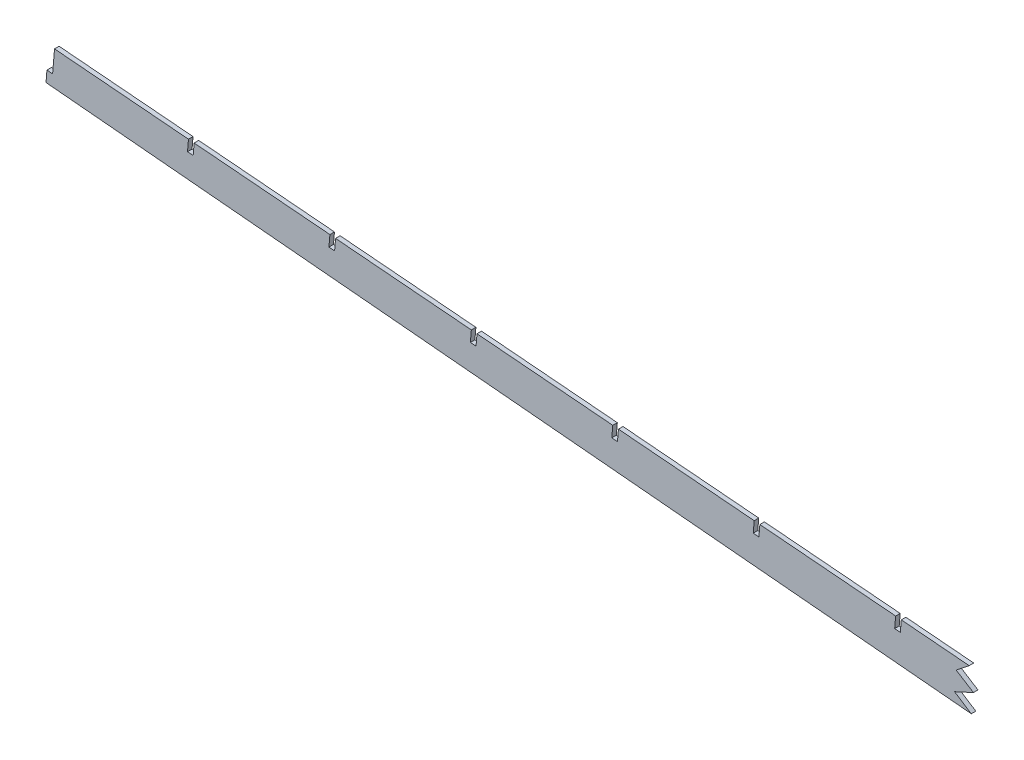
ISO-10303-21;
HEADER;
FILE_DESCRIPTION(('STEP AP214'),'2;1');
FILE_NAME('part.step','',(''),(''),'','','');
FILE_SCHEMA(('AUTOMOTIVE_DESIGN { 1 0 10303 214 1 1 1 1 }'));
ENDSEC;
DATA;
#1=APPLICATION_CONTEXT('core data for automotive mechanical design processes');
#2=APPLICATION_PROTOCOL_DEFINITION('international standard','automotive_design',2000,#1);
#3=PRODUCT_CONTEXT('',#1,'mechanical');
#4=PRODUCT('Part','Part','',(#3));
#5=PRODUCT_RELATED_PRODUCT_CATEGORY('part','',(#4));
#6=PRODUCT_DEFINITION_FORMATION('','',#4);
#7=PRODUCT_DEFINITION_CONTEXT('part definition',#1,'design');
#8=PRODUCT_DEFINITION('design','',#6,#7);
#9=PRODUCT_DEFINITION_SHAPE('','',#8);
#10=(LENGTH_UNIT() NAMED_UNIT(*) SI_UNIT(.MILLI.,.METRE.));
#11=(NAMED_UNIT(*) PLANE_ANGLE_UNIT() SI_UNIT($,.RADIAN.));
#12=(NAMED_UNIT(*) SI_UNIT($,.STERADIAN.) SOLID_ANGLE_UNIT());
#13=UNCERTAINTY_MEASURE_WITH_UNIT(LENGTH_MEASURE(1.E-05),#10,'distance_accuracy_value','');
#14=(GEOMETRIC_REPRESENTATION_CONTEXT(3) GLOBAL_UNCERTAINTY_ASSIGNED_CONTEXT((#13)) GLOBAL_UNIT_ASSIGNED_CONTEXT((#10,
#11,#12)) REPRESENTATION_CONTEXT('',''));
#15=CARTESIAN_POINT('',(0.,0.,0.));
#16=DIRECTION('',(0.,0.,1.));
#17=DIRECTION('',(1.,0.,0.));
#18=AXIS2_PLACEMENT_3D('',#15,#16,#17);
#19=CARTESIAN_POINT('',(1.61761442276217,19.2636563887038,2.54));
#20=DIRECTION('',(-0.083677843332315,-0.996492859249504,0.));
#21=DIRECTION('',(0.996492859249504,-0.083677843332315,0.));
#22=AXIS2_PLACEMENT_3D('',#19,#20,#21);
#23=PLANE('',#22);
#24=DIRECTION('',(0.,0.,1.));
#25=VECTOR('',#24,1.);
#26=CARTESIAN_POINT('',(-434.187522505009,55.8592362092406,-5.08));
#27=LINE('',#26,#25);
#28=CARTESIAN_POINT('',(-434.187522505009,55.8592362092406,0.));
#29=VERTEX_POINT('',#28);
#30=CARTESIAN_POINT('',(-434.187522505009,55.8592362092406,2.54));
#31=VERTEX_POINT('',#30);
#32=EDGE_CURVE('E381',#29,#31,#27,.T.);
#33=ORIENTED_EDGE('',*,*,#32,.F.);
#34=DIRECTION('',(-0.996492859249504,0.083677843332315,0.));
#35=VECTOR('',#34,1.);
#36=CARTESIAN_POINT('',(1.61761442276217,19.2636563887038,0.));
#37=LINE('',#36,#35);
#38=CARTESIAN_POINT('',(-472.090623145853,59.0420484971502,0.));
#39=VERTEX_POINT('',#38);
#40=EDGE_CURVE('E327',#29,#39,#37,.T.);
#41=ORIENTED_EDGE('',*,*,#40,.T.);
#42=DIRECTION('',(0.,0.,1.));
#43=VECTOR('',#42,1.);
#44=CARTESIAN_POINT('',(-472.090623145853,59.0420484971502,0.));
#45=LINE('',#44,#43);
#46=CARTESIAN_POINT('',(-472.090623145853,59.0420484971502,2.54));
#47=VERTEX_POINT('',#46);
#48=EDGE_CURVE('E526',#39,#47,#45,.T.);
#49=ORIENTED_EDGE('',*,*,#48,.T.);
#50=DIRECTION('',(-0.996492859249504,0.083677843332315,0.));
#51=VECTOR('',#50,1.);
#52=CARTESIAN_POINT('',(1.61761442276217,19.2636563887038,2.54));
#53=LINE('',#52,#51);
#54=EDGE_CURVE('E301',#31,#47,#53,.T.);
#55=ORIENTED_EDGE('',*,*,#54,.F.);
#56=EDGE_LOOP('',(#33,#41,#49,#55));
#57=FACE_BOUND('',#56,.T.);
#58=ADVANCED_FACE('F44',(#57),#23,.F.);
#59=DIRECTION('',(0.,0.,1.));
#60=VECTOR('',#59,1.);
#61=CARTESIAN_POINT('',(-866.940953694876,92.1985571391467,0.));
#62=LINE('',#61,#60);
#63=CARTESIAN_POINT('',(-866.940953694876,92.1985571391467,0.));
#64=VERTEX_POINT('',#63);
#65=CARTESIAN_POINT('',(-866.940953694876,92.1985571391467,2.54));
#66=VERTEX_POINT('',#65);
#67=EDGE_CURVE('E68',#64,#66,#62,.T.);
#68=ORIENTED_EDGE('',*,*,#67,.T.);
#69=CARTESIAN_POINT('',(-791.134752413189,85.8329325633276,2.54));
#70=VERTEX_POINT('',#69);
#71=EDGE_CURVE('E299',#70,#66,#53,.T.);
#72=ORIENTED_EDGE('',*,*,#71,.F.);
#73=DIRECTION('',(0.,0.,1.));
#74=VECTOR('',#73,1.);
#75=CARTESIAN_POINT('',(-791.134752413189,85.8329325633276,0.));
#76=LINE('',#75,#74);
#77=CARTESIAN_POINT('',(-791.134752413189,85.8329325633276,0.));
#78=VERTEX_POINT('',#77);
#79=EDGE_CURVE('E425',#78,#70,#76,.T.);
#80=ORIENTED_EDGE('',*,*,#79,.F.);
#81=EDGE_CURVE('E621',#78,#64,#37,.T.);
#82=ORIENTED_EDGE('',*,*,#81,.T.);
#83=EDGE_LOOP('',(#68,#72,#80,#82));
#84=FACE_BOUND('',#83,.T.);
#85=ADVANCED_FACE('F694',(#84),#23,.F.);
#86=DIRECTION('',(0.,0.,1.));
#87=VECTOR('',#86,1.);
#88=CARTESIAN_POINT('',(-787.970887585072,85.5672554107474,0.));
#89=LINE('',#88,#87);
#90=CARTESIAN_POINT('',(-787.970887585072,85.5672554107474,0.));
#91=VERTEX_POINT('',#90);
#92=CARTESIAN_POINT('',(-787.970887585072,85.5672554107474,2.54));
#93=VERTEX_POINT('',#92);
#94=EDGE_CURVE('E428',#91,#93,#89,.T.);
#95=ORIENTED_EDGE('',*,*,#94,.T.);
#96=CARTESIAN_POINT('',(-712.164686303384,79.2016308349282,2.54));
#97=VERTEX_POINT('',#96);
#98=EDGE_CURVE('E680',#97,#93,#53,.T.);
#99=ORIENTED_EDGE('',*,*,#98,.F.);
#100=DIRECTION('',(0.,0.,1.));
#101=VECTOR('',#100,1.);
#102=CARTESIAN_POINT('',(-712.164686303384,79.2016308349282,0.));
#103=LINE('',#102,#101);
#104=CARTESIAN_POINT('',(-712.164686303384,79.2016308349282,0.));
#105=VERTEX_POINT('',#104);
#106=EDGE_CURVE('E450',#105,#97,#103,.T.);
#107=ORIENTED_EDGE('',*,*,#106,.F.);
#108=EDGE_CURVE('E625',#105,#91,#37,.T.);
#109=ORIENTED_EDGE('',*,*,#108,.T.);
#110=EDGE_LOOP('',(#95,#99,#107,#109));
#111=FACE_BOUND('',#110,.T.);
#112=ADVANCED_FACE('F722',(#111),#23,.F.);
#113=DIRECTION('',(0.,0.,1.));
#114=VECTOR('',#113,1.);
#115=CARTESIAN_POINT('',(-709.000821475267,78.9359536823482,0.));
#116=LINE('',#115,#114);
#117=CARTESIAN_POINT('',(-709.000821475267,78.9359536823482,0.));
#118=VERTEX_POINT('',#117);
#119=CARTESIAN_POINT('',(-709.000821475267,78.9359536823482,2.54));
#120=VERTEX_POINT('',#119);
#121=EDGE_CURVE('E453',#118,#120,#116,.T.);
#122=ORIENTED_EDGE('',*,*,#121,.T.);
#123=CARTESIAN_POINT('',(-633.19462019358,72.5703291065289,2.54));
#124=VERTEX_POINT('',#123);
#125=EDGE_CURVE('E676',#124,#120,#53,.T.);
#126=ORIENTED_EDGE('',*,*,#125,.F.);
#127=DIRECTION('',(0.,0.,1.));
#128=VECTOR('',#127,1.);
#129=CARTESIAN_POINT('',(-633.19462019358,72.5703291065289,0.));
#130=LINE('',#129,#128);
#131=CARTESIAN_POINT('',(-633.19462019358,72.5703291065289,0.));
#132=VERTEX_POINT('',#131);
#133=EDGE_CURVE('E475',#132,#124,#130,.T.);
#134=ORIENTED_EDGE('',*,*,#133,.F.);
#135=EDGE_CURVE('E632',#132,#118,#37,.T.);
#136=ORIENTED_EDGE('',*,*,#135,.T.);
#137=EDGE_LOOP('',(#122,#126,#134,#136));
#138=FACE_BOUND('',#137,.T.);
#139=ADVANCED_FACE('F737',(#138),#23,.F.);
#140=DIRECTION('',(0.,0.,1.));
#141=VECTOR('',#140,1.);
#142=CARTESIAN_POINT('',(-630.030755365462,72.3046519539488,0.));
#143=LINE('',#142,#141);
#144=CARTESIAN_POINT('',(-630.030755365462,72.3046519539488,0.));
#145=VERTEX_POINT('',#144);
#146=CARTESIAN_POINT('',(-630.030755365462,72.3046519539488,2.54));
#147=VERTEX_POINT('',#146);
#148=EDGE_CURVE('E478',#145,#147,#143,.T.);
#149=ORIENTED_EDGE('',*,*,#148,.T.);
#150=CARTESIAN_POINT('',(-554.224554083775,65.9390273781296,2.54));
#151=VERTEX_POINT('',#150);
#152=EDGE_CURVE('E673',#151,#147,#53,.T.);
#153=ORIENTED_EDGE('',*,*,#152,.F.);
#154=DIRECTION('',(0.,0.,1.));
#155=VECTOR('',#154,1.);
#156=CARTESIAN_POINT('',(-554.224554083775,65.9390273781296,0.));
#157=LINE('',#156,#155);
#158=CARTESIAN_POINT('',(-554.224554083775,65.9390273781296,0.));
#159=VERTEX_POINT('',#158);
#160=EDGE_CURVE('E500',#159,#151,#157,.T.);
#161=ORIENTED_EDGE('',*,*,#160,.F.);
#162=EDGE_CURVE('E639',#159,#145,#37,.T.);
#163=ORIENTED_EDGE('',*,*,#162,.T.);
#164=EDGE_LOOP('',(#149,#153,#161,#163));
#165=FACE_BOUND('',#164,.T.);
#166=ADVANCED_FACE('F732',(#165),#23,.F.);
#167=DIRECTION('',(0.,0.,1.));
#168=VECTOR('',#167,1.);
#169=CARTESIAN_POINT('',(-551.060689255658,65.6733502255495,0.));
#170=LINE('',#169,#168);
#171=CARTESIAN_POINT('',(-551.060689255658,65.6733502255495,0.));
#172=VERTEX_POINT('',#171);
#173=CARTESIAN_POINT('',(-551.060689255658,65.6733502255495,2.54));
#174=VERTEX_POINT('',#173);
#175=EDGE_CURVE('E503',#172,#174,#170,.T.);
#176=ORIENTED_EDGE('',*,*,#175,.T.);
#177=CARTESIAN_POINT('',(-475.25448797397,59.3077256497303,2.54));
#178=VERTEX_POINT('',#177);
#179=EDGE_CURVE('E308',#178,#174,#53,.T.);
#180=ORIENTED_EDGE('',*,*,#179,.F.);
#181=DIRECTION('',(0.,0.,1.));
#182=VECTOR('',#181,1.);
#183=CARTESIAN_POINT('',(-475.25448797397,59.3077256497303,0.));
#184=LINE('',#183,#182);
#185=CARTESIAN_POINT('',(-475.25448797397,59.3077256497303,0.));
#186=VERTEX_POINT('',#185);
#187=EDGE_CURVE('E523',#186,#178,#184,.T.);
#188=ORIENTED_EDGE('',*,*,#187,.F.);
#189=EDGE_CURVE('E331',#186,#172,#37,.T.);
#190=ORIENTED_EDGE('',*,*,#189,.T.);
#191=EDGE_LOOP('',(#176,#180,#188,#190));
#192=FACE_BOUND('',#191,.T.);
#193=ADVANCED_FACE('F656',(#192),#23,.F.);
#194=CARTESIAN_POINT('',(0.019693696426435,0.216879368108901,2.54));
#195=DIRECTION('',(0.090432773308188,0.99590256225787,0.));
#196=DIRECTION('',(-0.99590256225787,0.090432773308188,0.));
#197=AXIS2_PLACEMENT_3D('',#194,#195,#196);
#198=PLANE('',#197);
#199=DIRECTION('',(0.99590256225787,-0.090432773308188,0.));
#200=VECTOR('',#199,1.);
#201=CARTESIAN_POINT('',(0.019693696426435,0.216879368108901,0.));
#202=LINE('',#201,#200);
#203=CARTESIAN_POINT('',(-949.121092485134,86.4034570587159,0.));
#204=VERTEX_POINT('',#203);
#205=CARTESIAN_POINT('',(-945.969713577558,86.1172965996938,0.));
#206=VERTEX_POINT('',#205);
#207=EDGE_CURVE('E315',#204,#206,#202,.T.);
#208=ORIENTED_EDGE('',*,*,#207,.F.);
#209=DIRECTION('',(0.,0.,-1.));
#210=VECTOR('',#209,1.);
#211=CARTESIAN_POINT('',(-949.121092485134,86.4034570587159,2.54));
#212=LINE('',#211,#210);
#213=CARTESIAN_POINT('',(-949.121092485134,86.4034570587159,2.54));
#214=VERTEX_POINT('',#213);
#215=EDGE_CURVE('E351',#214,#204,#212,.T.);
#216=ORIENTED_EDGE('',*,*,#215,.F.);
#217=DIRECTION('',(0.99590256225787,-0.090432773308188,0.));
#218=VECTOR('',#217,1.);
#219=CARTESIAN_POINT('',(0.019693696426435,0.216879368108901,2.54));
#220=LINE('',#219,#218);
#221=CARTESIAN_POINT('',(-945.969713577558,86.1172965996938,2.54));
#222=VERTEX_POINT('',#221);
#223=EDGE_CURVE('E302',#214,#222,#220,.T.);
#224=ORIENTED_EDGE('',*,*,#223,.T.);
#225=DIRECTION('',(0.,0.,-1.));
#226=VECTOR('',#225,1.);
#227=CARTESIAN_POINT('',(-945.969713577558,86.1172965996938,2.54));
#228=LINE('',#227,#226);
#229=EDGE_CURVE('E314',#222,#206,#228,.T.);
#230=ORIENTED_EDGE('',*,*,#229,.T.);
#231=EDGE_LOOP('',(#208,#216,#224,#230));
#232=FACE_BOUND('',#231,.T.);
#233=ADVANCED_FACE('F46',(#232),#198,.T.);
#234=CARTESIAN_POINT('',(-949.680062310563,79.7468629425904,2.54));
#235=DIRECTION('',(-0.996492859249505,0.0836778433323086,0.));
#236=DIRECTION('',(-0.0836778433323086,-0.996492859249505,0.));
#237=AXIS2_PLACEMENT_3D('',#234,#235,#236);
#238=PLANE('',#237);
#239=DIRECTION('',(0.0836778433323086,0.996492859249505,0.));
#240=VECTOR('',#239,1.);
#241=CARTESIAN_POINT('',(-949.680062310563,79.7468629425904,0.));
#242=LINE('',#241,#240);
#243=CARTESIAN_POINT('',(-949.652446790294,80.0757274024815,0.));
#244=VERTEX_POINT('',#243);
#245=EDGE_CURVE('E319',#244,#204,#242,.T.);
#246=ORIENTED_EDGE('',*,*,#245,.F.);
#247=DIRECTION('',(0.,0.,-1.));
#248=VECTOR('',#247,1.);
#249=CARTESIAN_POINT('',(-949.652446790294,80.0757274024815,2.54));
#250=LINE('',#249,#248);
#251=CARTESIAN_POINT('',(-949.652446790294,80.0757274024815,2.54));
#252=VERTEX_POINT('',#251);
#253=EDGE_CURVE('E348',#252,#244,#250,.T.);
#254=ORIENTED_EDGE('',*,*,#253,.F.);
#255=DIRECTION('',(0.0836778433323086,0.996492859249505,0.));
#256=VECTOR('',#255,1.);
#257=CARTESIAN_POINT('',(-949.680062310563,79.7468629425904,2.54));
#258=LINE('',#257,#256);
#259=EDGE_CURVE('E292',#252,#214,#258,.T.);
#260=ORIENTED_EDGE('',*,*,#259,.T.);
#261=ORIENTED_EDGE('',*,*,#215,.T.);
#262=EDGE_LOOP('',(#246,#254,#260,#261));
#263=FACE_BOUND('',#262,.T.);
#264=ADVANCED_FACE('F605',(#263),#238,.T.);
#265=CARTESIAN_POINT('',(-0.554555489941972,-6.10710326019602,2.54));
#266=DIRECTION('',(0.0904329273730838,0.995902548268019,0.));
#267=DIRECTION('',(-0.995902548268019,0.0904329273730838,0.));
#268=AXIS2_PLACEMENT_3D('',#265,#266,#267);
#269=PLANE('',#268);
#270=DIRECTION('',(0.995902548268019,-0.0904329273730838,0.));
#271=VECTOR('',#270,1.);
#272=CARTESIAN_POINT('',(-0.554555489941972,-6.10710326019602,0.));
#273=LINE('',#272,#271);
#274=CARTESIAN_POINT('',(-433.014300590674,33.1624023641152,0.));
#275=VERTEX_POINT('',#274);
#276=EDGE_CURVE('E285',#244,#275,#273,.T.);
#277=ORIENTED_EDGE('',*,*,#276,.T.);
#278=DIRECTION('',(0.,0.,1.));
#279=VECTOR('',#278,1.);
#280=CARTESIAN_POINT('',(-433.014300590674,33.1624023641152,-5.08));
#281=LINE('',#280,#279);
#282=CARTESIAN_POINT('',(-433.014300590674,33.1624023641152,2.54));
#283=VERTEX_POINT('',#282);
#284=EDGE_CURVE('E268',#275,#283,#281,.T.);
#285=ORIENTED_EDGE('',*,*,#284,.T.);
#286=DIRECTION('',(0.995902548268019,-0.0904329273730838,0.));
#287=VECTOR('',#286,1.);
#288=CARTESIAN_POINT('',(-0.554555489941972,-6.10710326019602,2.54));
#289=LINE('',#288,#287);
#290=EDGE_CURVE('E282',#252,#283,#289,.T.);
#291=ORIENTED_EDGE('',*,*,#290,.F.);
#292=ORIENTED_EDGE('',*,*,#253,.T.);
#293=EDGE_LOOP('',(#277,#285,#291,#292));
#294=FACE_BOUND('',#293,.T.);
#295=ADVANCED_FACE('F281',(#294),#269,.F.);
#296=CARTESIAN_POINT('',(-870.104818522994,92.4642342917268,2.54));
#297=VERTEX_POINT('',#296);
#298=CARTESIAN_POINT('',(-944.898583059683,98.7448421787204,2.54));
#299=VERTEX_POINT('',#298);
#300=EDGE_CURVE('E294',#297,#299,#53,.T.);
#301=ORIENTED_EDGE('',*,*,#300,.F.);
#302=DIRECTION('',(0.,0.,1.));
#303=VECTOR('',#302,1.);
#304=CARTESIAN_POINT('',(-870.104818522994,92.4642342917268,0.));
#305=LINE('',#304,#303);
#306=CARTESIAN_POINT('',(-870.104818522994,92.4642342917268,0.));
#307=VERTEX_POINT('',#306);
#308=EDGE_CURVE('E402',#307,#297,#305,.T.);
#309=ORIENTED_EDGE('',*,*,#308,.F.);
#310=CARTESIAN_POINT('',(-944.898583059683,98.7448421787204,0.));
#311=VERTEX_POINT('',#310);
#312=EDGE_CURVE('E326',#307,#311,#37,.T.);
#313=ORIENTED_EDGE('',*,*,#312,.T.);
#314=DIRECTION('',(0.,0.,-1.));
#315=VECTOR('',#314,1.);
#316=CARTESIAN_POINT('',(-944.898583059683,98.7448421787204,2.54));
#317=LINE('',#316,#315);
#318=EDGE_CURVE('E344',#299,#311,#317,.T.);
#319=ORIENTED_EDGE('',*,*,#318,.F.);
#320=EDGE_LOOP('',(#301,#309,#313,#319));
#321=FACE_BOUND('',#320,.T.);
#322=ADVANCED_FACE('F618',(#321),#23,.F.);
#323=CARTESIAN_POINT('',(-946.516197482446,79.4811857900151,2.54));
#324=DIRECTION('',(0.996492859249505,-0.0836778433323135,0.));
#325=DIRECTION('',(0.0836778433323135,0.996492859249505,0.));
#326=AXIS2_PLACEMENT_3D('',#323,#324,#325);
#327=PLANE('',#326);
#328=DIRECTION('',(-0.0836778433323135,-0.996492859249505,0.));
#329=VECTOR('',#328,1.);
#330=CARTESIAN_POINT('',(-946.516197482446,79.4811857900151,0.));
#331=LINE('',#330,#329);
#332=CARTESIAN_POINT('',(-945.957227657017,86.1377799061358,0.));
#333=VERTEX_POINT('',#332);
#334=EDGE_CURVE('E330',#311,#333,#331,.T.);
#335=ORIENTED_EDGE('',*,*,#334,.T.);
#336=DIRECTION('',(0.,0.,-1.));
#337=VECTOR('',#336,1.);
#338=CARTESIAN_POINT('',(-945.957227657017,86.1377799061358,2.54));
#339=LINE('',#338,#337);
#340=CARTESIAN_POINT('',(-945.957227657017,86.1377799061358,2.54));
#341=VERTEX_POINT('',#340);
#342=EDGE_CURVE('E340',#341,#333,#339,.T.);
#343=ORIENTED_EDGE('',*,*,#342,.F.);
#344=DIRECTION('',(-0.0836778433323135,-0.996492859249505,0.));
#345=VECTOR('',#344,1.);
#346=CARTESIAN_POINT('',(-946.516197482446,79.4811857900151,2.54));
#347=LINE('',#346,#345);
#348=EDGE_CURVE('E307',#299,#341,#347,.T.);
#349=ORIENTED_EDGE('',*,*,#348,.F.);
#350=ORIENTED_EDGE('',*,*,#318,.T.);
#351=EDGE_LOOP('',(#335,#343,#349,#350));
#352=FACE_BOUND('',#351,.T.);
#353=ADVANCED_FACE('F614',(#352),#327,.F.);
#354=CARTESIAN_POINT('',(-727.971327351341,443.746334378368,2.54));
#355=DIRECTION('',(0.853868439769701,-0.520488892835627,0.));
#356=DIRECTION('',(0.520488892835627,0.853868439769701,0.));
#357=AXIS2_PLACEMENT_3D('',#354,#355,#356);
#358=PLANE('',#357);
#359=DIRECTION('',(-0.520488892835627,-0.853868439769701,0.));
#360=VECTOR('',#359,1.);
#361=CARTESIAN_POINT('',(-727.971327351341,443.746334378368,0.));
#362=LINE('',#361,#360);
#363=EDGE_CURVE('E334',#333,#206,#362,.T.);
#364=ORIENTED_EDGE('',*,*,#363,.T.);
#365=ORIENTED_EDGE('',*,*,#229,.F.);
#366=DIRECTION('',(-0.520488892835627,-0.853868439769701,0.));
#367=VECTOR('',#366,1.);
#368=CARTESIAN_POINT('',(-727.971327351341,443.746334378368,2.54));
#369=LINE('',#368,#367);
#370=EDGE_CURVE('E311',#341,#222,#369,.T.);
#371=ORIENTED_EDGE('',*,*,#370,.F.);
#372=ORIENTED_EDGE('',*,*,#342,.T.);
#373=EDGE_LOOP('',(#364,#365,#371,#372));
#374=FACE_BOUND('',#373,.T.);
#375=ADVANCED_FACE('F610',(#374),#358,.F.);
#376=CARTESIAN_POINT('',(0.,0.,2.54));
#377=DIRECTION('',(0.,0.,1.));
#378=DIRECTION('',(1.,0.,0.));
#379=AXIS2_PLACEMENT_3D('',#376,#377,#378);
#380=PLANE('',#379);
#381=DIRECTION('',(0.84086068360967,-0.541251615017893,0.));
#382=VECTOR('',#381,1.);
#383=CARTESIAN_POINT('',(-442.349656028265,39.1714551190514,2.54));
#384=LINE('',#383,#382);
#385=CARTESIAN_POINT('',(-442.349656028265,39.1714551190514,2.54));
#386=VERTEX_POINT('',#385);
#387=EDGE_CURVE('E265',#386,#283,#384,.T.);
#388=ORIENTED_EDGE('',*,*,#387,.F.);
#389=DIRECTION('',(-0.908501198201837,-0.417882247607896,0.));
#390=VECTOR('',#389,1.);
#391=CARTESIAN_POINT('',(-431.803024179244,44.0225771984557,2.54));
#392=LINE('',#391,#390);
#393=CARTESIAN_POINT('',(-431.803024179244,44.0225771984557,2.54));
#394=VERTEX_POINT('',#393);
#395=EDGE_CURVE('E276',#394,#386,#392,.T.);
#396=ORIENTED_EDGE('',*,*,#395,.F.);
#397=DIRECTION('',(0.846984344306244,-0.531617833128387,0.));
#398=VECTOR('',#397,1.);
#399=CARTESIAN_POINT('',(-441.444486835667,50.0741335466362,2.54));
#400=LINE('',#399,#398);
#401=CARTESIAN_POINT('',(-441.444486835667,50.0741335466362,2.54));
#402=VERTEX_POINT('',#401);
#403=EDGE_CURVE('E374',#402,#394,#400,.T.);
#404=ORIENTED_EDGE('',*,*,#403,.F.);
#405=DIRECTION('',(-0.781943519306331,-0.623349286207043,0.));
#406=VECTOR('',#405,1.);
#407=CARTESIAN_POINT('',(-434.187522505009,55.8592362092406,2.54));
#408=LINE('',#407,#406);
#409=EDGE_CURVE('E1143',#31,#402,#408,.T.);
#410=ORIENTED_EDGE('',*,*,#409,.F.);
#411=ORIENTED_EDGE('',*,*,#54,.T.);
#412=DIRECTION('',(-0.0836778433323133,-0.996492859249505,0.));
#413=VECTOR('',#412,1.);
#414=CARTESIAN_POINT('',(-473.708237568615,39.7783921084456,2.54));
#415=LINE('',#414,#413);
#416=CARTESIAN_POINT('',(-472.62160579502,52.718744774097,2.54));
#417=VERTEX_POINT('',#416);
#418=EDGE_CURVE('E401',#47,#417,#415,.T.);
#419=ORIENTED_EDGE('',*,*,#418,.T.);
#420=DIRECTION('',(-0.996492061595856,0.0836873417933722,0.));
#421=VECTOR('',#420,1.);
#422=CARTESIAN_POINT('',(1.08637591309473,12.9358269734597,2.54));
#423=LINE('',#422,#421);
#424=CARTESIAN_POINT('',(-475.785468090731,52.984452084303,2.54));
#425=VERTEX_POINT('',#424);
#426=EDGE_CURVE('E539',#417,#425,#423,.T.);
#427=ORIENTED_EDGE('',*,*,#426,.T.);
#428=DIRECTION('',(-0.0836778433323162,-0.996492859249504,0.));
#429=VECTOR('',#428,1.);
#430=CARTESIAN_POINT('',(-476.872102396732,40.044069261027,2.54));
#431=LINE('',#430,#429);
#432=EDGE_CURVE('E536',#178,#425,#431,.T.);
#433=ORIENTED_EDGE('',*,*,#432,.F.);
#434=ORIENTED_EDGE('',*,*,#179,.T.);
#435=DIRECTION('',(-0.0836778433323145,-0.996492859249505,0.));
#436=VECTOR('',#435,1.);
#437=CARTESIAN_POINT('',(-552.67830367842,46.4096938368454,2.54));
#438=LINE('',#437,#436);
#439=CARTESIAN_POINT('',(-551.591608695956,59.3507992368394,2.54));
#440=VERTEX_POINT('',#439);
#441=EDGE_CURVE('E543',#174,#440,#438,.T.);
#442=ORIENTED_EDGE('',*,*,#441,.T.);
#443=DIRECTION('',(-0.996492061595856,0.0836873417933722,0.));
#444=VECTOR('',#443,1.);
#445=CARTESIAN_POINT('',(1.08637591309473,12.9358269734597,2.54));
#446=LINE('',#445,#444);
#447=CARTESIAN_POINT('',(-554.755470991666,59.6165065470454,2.54));
#448=VERTEX_POINT('',#447);
#449=EDGE_CURVE('E550',#440,#448,#446,.T.);
#450=ORIENTED_EDGE('',*,*,#449,.T.);
#451=DIRECTION('',(-0.0836778433323165,-0.996492859249504,0.));
#452=VECTOR('',#451,1.);
#453=CARTESIAN_POINT('',(-555.842168506537,46.6753709894266,2.54));
#454=LINE('',#453,#452);
#455=EDGE_CURVE('E547',#151,#448,#454,.T.);
#456=ORIENTED_EDGE('',*,*,#455,.F.);
#457=ORIENTED_EDGE('',*,*,#152,.T.);
#458=DIRECTION('',(-0.0836778433323169,-0.996492859249504,0.));
#459=VECTOR('',#458,1.);
#460=CARTESIAN_POINT('',(-631.648369788225,53.0409955652461,2.54));
#461=LINE('',#460,#459);
#462=CARTESIAN_POINT('',(-630.561611596892,65.9828536995818,2.54));
#463=VERTEX_POINT('',#462);
#464=EDGE_CURVE('E554',#147,#463,#461,.T.);
#465=ORIENTED_EDGE('',*,*,#464,.T.);
#466=DIRECTION('',(-0.996492061595856,0.0836873417933722,0.));
#467=VECTOR('',#466,1.);
#468=CARTESIAN_POINT('',(1.08637591309473,12.9358269734597,2.54));
#469=LINE('',#468,#467);
#470=CARTESIAN_POINT('',(-633.725473892603,66.2485610097879,2.54));
#471=VERTEX_POINT('',#470);
#472=EDGE_CURVE('E561',#463,#471,#469,.T.);
#473=ORIENTED_EDGE('',*,*,#472,.T.);
#474=DIRECTION('',(-0.083677843332319,-0.996492859249504,0.));
#475=VECTOR('',#474,1.);
#476=CARTESIAN_POINT('',(-634.812234616342,53.3066727178276,2.54));
#477=LINE('',#476,#475);
#478=EDGE_CURVE('E558',#124,#471,#477,.T.);
#479=ORIENTED_EDGE('',*,*,#478,.F.);
#480=ORIENTED_EDGE('',*,*,#125,.T.);
#481=DIRECTION('',(-0.0836778433323155,-0.996492859249504,0.));
#482=VECTOR('',#481,1.);
#483=CARTESIAN_POINT('',(-710.61843589803,59.6722972936446,2.54));
#484=LINE('',#483,#482);
#485=CARTESIAN_POINT('',(-709.531614497828,72.6149081623243,2.54));
#486=VERTEX_POINT('',#485);
#487=EDGE_CURVE('E565',#120,#486,#484,.T.);
#488=ORIENTED_EDGE('',*,*,#487,.T.);
#489=DIRECTION('',(-0.996492061595856,0.0836873417933722,0.));
#490=VECTOR('',#489,1.);
#491=CARTESIAN_POINT('',(1.08637591309473,12.9358269734597,2.54));
#492=LINE('',#491,#490);
#493=CARTESIAN_POINT('',(-712.695476793539,72.8806154725303,2.54));
#494=VERTEX_POINT('',#493);
#495=EDGE_CURVE('E572',#486,#494,#492,.T.);
#496=ORIENTED_EDGE('',*,*,#495,.T.);
#497=DIRECTION('',(-0.0836778433323155,-0.996492859249504,0.));
#498=VECTOR('',#497,1.);
#499=CARTESIAN_POINT('',(-713.782300726147,59.9379744462247,2.54));
#500=LINE('',#499,#498);
#501=EDGE_CURVE('E569',#97,#494,#500,.T.);
#502=ORIENTED_EDGE('',*,*,#501,.F.);
#503=ORIENTED_EDGE('',*,*,#98,.T.);
#504=DIRECTION('',(-0.0836778433323136,-0.996492859249505,0.));
#505=VECTOR('',#504,1.);
#506=CARTESIAN_POINT('',(-789.588502007834,66.3035990220424,2.54));
#507=LINE('',#506,#505);
#508=CARTESIAN_POINT('',(-788.501617398764,79.2469626250667,2.54));
#509=VERTEX_POINT('',#508);
#510=EDGE_CURVE('E576',#93,#509,#507,.T.);
#511=ORIENTED_EDGE('',*,*,#510,.T.);
#512=DIRECTION('',(-0.996492061595856,0.0836873417933722,0.));
#513=VECTOR('',#512,1.);
#514=CARTESIAN_POINT('',(1.08637591309473,12.9358269734597,2.54));
#515=LINE('',#514,#513);
#516=CARTESIAN_POINT('',(-791.665479694475,79.5126699352728,2.54));
#517=VERTEX_POINT('',#516);
#518=EDGE_CURVE('E583',#509,#517,#515,.T.);
#519=ORIENTED_EDGE('',*,*,#518,.T.);
#520=DIRECTION('',(-0.083677843332316,-0.996492859249504,0.));
#521=VECTOR('',#520,1.);
#522=CARTESIAN_POINT('',(-792.752366835952,66.5692761746244,2.54));
#523=LINE('',#522,#521);
#524=EDGE_CURVE('E580',#70,#517,#523,.T.);
#525=ORIENTED_EDGE('',*,*,#524,.F.);
#526=ORIENTED_EDGE('',*,*,#71,.T.);
#527=DIRECTION('',(-0.08367784333232,-0.996492859249504,0.));
#528=VECTOR('',#527,1.);
#529=CARTESIAN_POINT('',(-868.558568117638,72.9349007504472,2.54));
#530=LINE('',#529,#528);
#531=CARTESIAN_POINT('',(-867.471620299699,85.8790170878092,2.54));
#532=VERTEX_POINT('',#531);
#533=EDGE_CURVE('E587',#66,#532,#530,.T.);
#534=ORIENTED_EDGE('',*,*,#533,.T.);
#535=DIRECTION('',(-0.996492061595856,0.0836873417933722,0.));
#536=VECTOR('',#535,1.);
#537=CARTESIAN_POINT('',(1.08637591309473,12.9358269734597,2.54));
#538=LINE('',#537,#536);
#539=CARTESIAN_POINT('',(-870.63548259541,86.1447243980152,2.54));
#540=VERTEX_POINT('',#539);
#541=EDGE_CURVE('E320',#532,#540,#538,.T.);
#542=ORIENTED_EDGE('',*,*,#541,.T.);
#543=DIRECTION('',(-0.0836778433323175,-0.996492859249504,0.));
#544=VECTOR('',#543,1.);
#545=CARTESIAN_POINT('',(-871.722432945756,73.2005779030251,2.54));
#546=LINE('',#545,#544);
#547=EDGE_CURVE('E591',#297,#540,#546,.T.);
#548=ORIENTED_EDGE('',*,*,#547,.F.);
#549=ORIENTED_EDGE('',*,*,#300,.T.);
#550=ORIENTED_EDGE('',*,*,#348,.T.);
#551=ORIENTED_EDGE('',*,*,#370,.T.);
#552=ORIENTED_EDGE('',*,*,#223,.F.);
#553=ORIENTED_EDGE('',*,*,#259,.F.);
#554=ORIENTED_EDGE('',*,*,#290,.T.);
#555=EDGE_LOOP('',(#388,#396,#404,#410,#411,#419,#427,#433,#434,#442,#450,#456,#457,#465,#473,
#479,#480,#488,#496,#502,#503,#511,#519,#525,#526,#534,#542,#548,#549,#550,#551,#552,#553,#554));
#556=FACE_BOUND('',#555,.T.);
#557=ADVANCED_FACE('F289',(#556),#380,.T.);
#558=CARTESIAN_POINT('',(0.,0.,0.));
#559=DIRECTION('',(0.,0.,1.));
#560=DIRECTION('',(1.,0.,0.));
#561=AXIS2_PLACEMENT_3D('',#558,#559,#560);
#562=PLANE('',#561);
#563=DIRECTION('',(-0.908501198201837,-0.417882247607896,0.));
#564=VECTOR('',#563,1.);
#565=CARTESIAN_POINT('',(-92.1168688143804,200.267626039457,0.));
#566=LINE('',#565,#564);
#567=CARTESIAN_POINT('',(-431.803024179244,44.0225771984557,0.));
#568=VERTEX_POINT('',#567);
#569=CARTESIAN_POINT('',(-442.349656028265,39.1714551190514,0.));
#570=VERTEX_POINT('',#569);
#571=EDGE_CURVE('E53',#568,#570,#566,.T.);
#572=ORIENTED_EDGE('',*,*,#571,.T.);
#573=DIRECTION('',(0.84086068360967,-0.541251615017893,0.));
#574=VECTOR('',#573,1.);
#575=CARTESIAN_POINT('',(-111.76019315523,-173.624890548823,0.));
#576=LINE('',#575,#574);
#577=EDGE_CURVE('E11',#570,#275,#576,.T.);
#578=ORIENTED_EDGE('',*,*,#577,.T.);
#579=ORIENTED_EDGE('',*,*,#276,.F.);
#580=ORIENTED_EDGE('',*,*,#245,.T.);
#581=ORIENTED_EDGE('',*,*,#207,.T.);
#582=ORIENTED_EDGE('',*,*,#363,.F.);
#583=ORIENTED_EDGE('',*,*,#334,.F.);
#584=ORIENTED_EDGE('',*,*,#312,.F.);
#585=DIRECTION('',(-0.0836778433323175,-0.996492859249504,0.));
#586=VECTOR('',#585,1.);
#587=CARTESIAN_POINT('',(-871.722432945756,73.2005779030251,0.));
#588=LINE('',#587,#586);
#589=CARTESIAN_POINT('',(-870.63548259541,86.1447243980152,0.));
#590=VERTEX_POINT('',#589);
#591=EDGE_CURVE('E392',#307,#590,#588,.T.);
#592=ORIENTED_EDGE('',*,*,#591,.T.);
#593=DIRECTION('',(-0.996492061595856,0.0836873417933722,0.));
#594=VECTOR('',#593,1.);
#595=CARTESIAN_POINT('',(1.08637591309473,12.9358269734597,0.));
#596=LINE('',#595,#594);
#597=CARTESIAN_POINT('',(-867.471620299699,85.8790170878092,0.));
#598=VERTEX_POINT('',#597);
#599=EDGE_CURVE('E385',#598,#590,#596,.T.);
#600=ORIENTED_EDGE('',*,*,#599,.F.);
#601=DIRECTION('',(-0.08367784333232,-0.996492859249504,0.));
#602=VECTOR('',#601,1.);
#603=CARTESIAN_POINT('',(-868.558568117638,72.9349007504472,0.));
#604=LINE('',#603,#602);
#605=EDGE_CURVE('E388',#64,#598,#604,.T.);
#606=ORIENTED_EDGE('',*,*,#605,.F.);
#607=ORIENTED_EDGE('',*,*,#81,.F.);
#608=DIRECTION('',(-0.083677843332316,-0.996492859249504,0.));
#609=VECTOR('',#608,1.);
#610=CARTESIAN_POINT('',(-792.752366835952,66.5692761746244,0.));
#611=LINE('',#610,#609);
#612=CARTESIAN_POINT('',(-791.665479694475,79.5126699352728,0.));
#613=VERTEX_POINT('',#612);
#614=EDGE_CURVE('E417',#78,#613,#611,.T.);
#615=ORIENTED_EDGE('',*,*,#614,.T.);
#616=DIRECTION('',(-0.996492061595856,0.0836873417933722,0.));
#617=VECTOR('',#616,1.);
#618=CARTESIAN_POINT('',(1.08637591309473,12.9358269734597,0.));
#619=LINE('',#618,#617);
#620=CARTESIAN_POINT('',(-788.501617398764,79.2469626250667,0.));
#621=VERTEX_POINT('',#620);
#622=EDGE_CURVE('E410',#621,#613,#619,.T.);
#623=ORIENTED_EDGE('',*,*,#622,.F.);
#624=DIRECTION('',(-0.0836778433323136,-0.996492859249505,0.));
#625=VECTOR('',#624,1.);
#626=CARTESIAN_POINT('',(-789.588502007834,66.3035990220424,0.));
#627=LINE('',#626,#625);
#628=EDGE_CURVE('E413',#91,#621,#627,.T.);
#629=ORIENTED_EDGE('',*,*,#628,.F.);
#630=ORIENTED_EDGE('',*,*,#108,.F.);
#631=DIRECTION('',(-0.0836778433323155,-0.996492859249504,0.));
#632=VECTOR('',#631,1.);
#633=CARTESIAN_POINT('',(-713.782300726147,59.9379744462247,0.));
#634=LINE('',#633,#632);
#635=CARTESIAN_POINT('',(-712.695476793539,72.8806154725303,0.));
#636=VERTEX_POINT('',#635);
#637=EDGE_CURVE('E442',#105,#636,#634,.T.);
#638=ORIENTED_EDGE('',*,*,#637,.T.);
#639=DIRECTION('',(-0.996492061595856,0.0836873417933722,0.));
#640=VECTOR('',#639,1.);
#641=CARTESIAN_POINT('',(1.08637591309473,12.9358269734597,0.));
#642=LINE('',#641,#640);
#643=CARTESIAN_POINT('',(-709.531614497828,72.6149081623243,0.));
#644=VERTEX_POINT('',#643);
#645=EDGE_CURVE('E435',#644,#636,#642,.T.);
#646=ORIENTED_EDGE('',*,*,#645,.F.);
#647=DIRECTION('',(-0.0836778433323155,-0.996492859249504,0.));
#648=VECTOR('',#647,1.);
#649=CARTESIAN_POINT('',(-710.61843589803,59.6722972936446,0.));
#650=LINE('',#649,#648);
#651=EDGE_CURVE('E438',#118,#644,#650,.T.);
#652=ORIENTED_EDGE('',*,*,#651,.F.);
#653=ORIENTED_EDGE('',*,*,#135,.F.);
#654=DIRECTION('',(-0.083677843332319,-0.996492859249504,0.));
#655=VECTOR('',#654,1.);
#656=CARTESIAN_POINT('',(-634.812234616342,53.3066727178276,0.));
#657=LINE('',#656,#655);
#658=CARTESIAN_POINT('',(-633.725473892603,66.2485610097879,0.));
#659=VERTEX_POINT('',#658);
#660=EDGE_CURVE('E467',#132,#659,#657,.T.);
#661=ORIENTED_EDGE('',*,*,#660,.T.);
#662=DIRECTION('',(-0.996492061595856,0.0836873417933722,0.));
#663=VECTOR('',#662,1.);
#664=CARTESIAN_POINT('',(1.08637591309473,12.9358269734597,0.));
#665=LINE('',#664,#663);
#666=CARTESIAN_POINT('',(-630.561611596892,65.9828536995818,0.));
#667=VERTEX_POINT('',#666);
#668=EDGE_CURVE('E460',#667,#659,#665,.T.);
#669=ORIENTED_EDGE('',*,*,#668,.F.);
#670=DIRECTION('',(-0.0836778433323169,-0.996492859249504,0.));
#671=VECTOR('',#670,1.);
#672=CARTESIAN_POINT('',(-631.648369788224,53.0409955652461,0.));
#673=LINE('',#672,#671);
#674=EDGE_CURVE('E463',#145,#667,#673,.T.);
#675=ORIENTED_EDGE('',*,*,#674,.F.);
#676=ORIENTED_EDGE('',*,*,#162,.F.);
#677=DIRECTION('',(-0.0836778433323165,-0.996492859249504,0.));
#678=VECTOR('',#677,1.);
#679=CARTESIAN_POINT('',(-555.842168506537,46.6753709894266,0.));
#680=LINE('',#679,#678);
#681=CARTESIAN_POINT('',(-554.755470991666,59.6165065470454,0.));
#682=VERTEX_POINT('',#681);
#683=EDGE_CURVE('E492',#159,#682,#680,.T.);
#684=ORIENTED_EDGE('',*,*,#683,.T.);
#685=DIRECTION('',(-0.996492061595856,0.0836873417933722,0.));
#686=VECTOR('',#685,1.);
#687=CARTESIAN_POINT('',(1.08637591309473,12.9358269734597,0.));
#688=LINE('',#687,#686);
#689=CARTESIAN_POINT('',(-551.591608695956,59.3507992368394,0.));
#690=VERTEX_POINT('',#689);
#691=EDGE_CURVE('E485',#690,#682,#688,.T.);
#692=ORIENTED_EDGE('',*,*,#691,.F.);
#693=DIRECTION('',(-0.0836778433323145,-0.996492859249504,0.));
#694=VECTOR('',#693,1.);
#695=CARTESIAN_POINT('',(-552.67830367842,46.4096938368454,0.));
#696=LINE('',#695,#694);
#697=EDGE_CURVE('E488',#172,#690,#696,.T.);
#698=ORIENTED_EDGE('',*,*,#697,.F.);
#699=ORIENTED_EDGE('',*,*,#189,.F.);
#700=DIRECTION('',(-0.0836778433323162,-0.996492859249504,0.));
#701=VECTOR('',#700,1.);
#702=CARTESIAN_POINT('',(-476.872102396732,40.044069261027,0.));
#703=LINE('',#702,#701);
#704=CARTESIAN_POINT('',(-475.785468090731,52.984452084303,0.));
#705=VERTEX_POINT('',#704);
#706=EDGE_CURVE('E515',#186,#705,#703,.T.);
#707=ORIENTED_EDGE('',*,*,#706,.T.);
#708=DIRECTION('',(-0.996492061595856,0.0836873417933722,0.));
#709=VECTOR('',#708,1.);
#710=CARTESIAN_POINT('',(1.08637591309473,12.9358269734597,0.));
#711=LINE('',#710,#709);
#712=CARTESIAN_POINT('',(-472.62160579502,52.718744774097,0.));
#713=VERTEX_POINT('',#712);
#714=EDGE_CURVE('E287',#713,#705,#711,.T.);
#715=ORIENTED_EDGE('',*,*,#714,.F.);
#716=DIRECTION('',(-0.0836778433323133,-0.996492859249505,0.));
#717=VECTOR('',#716,1.);
#718=CARTESIAN_POINT('',(-473.708237568615,39.7783921084456,0.));
#719=LINE('',#718,#717);
#720=EDGE_CURVE('E512',#39,#713,#719,.T.);
#721=ORIENTED_EDGE('',*,*,#720,.F.);
#722=ORIENTED_EDGE('',*,*,#40,.F.);
#723=DIRECTION('',(-0.781943519306331,-0.623349286207043,0.));
#724=VECTOR('',#723,1.);
#725=CARTESIAN_POINT('',(-195.936913609476,245.787719950843,0.));
#726=LINE('',#725,#724);
#727=CARTESIAN_POINT('',(-441.444486835667,50.0741335466362,0.));
#728=VERTEX_POINT('',#727);
#729=EDGE_CURVE('E354',#29,#728,#726,.T.);
#730=ORIENTED_EDGE('',*,*,#729,.T.);
#731=DIRECTION('',(0.846984344306244,-0.531617833128387,0.));
#732=VECTOR('',#731,1.);
#733=CARTESIAN_POINT('',(-102.212966958294,-162.847777865757,0.));
#734=LINE('',#733,#732);
#735=EDGE_CURVE('E358',#728,#568,#734,.T.);
#736=ORIENTED_EDGE('',*,*,#735,.T.);
#737=EDGE_LOOP('',(#572,#578,#579,#580,#581,#582,#583,#584,#592,#600,#606,#607,#615,#623,#629,
#630,#638,#646,#652,#653,#661,#669,#675,#676,#684,#692,#698,#699,#707,#715,#721,#722,#730,#736));
#738=FACE_BOUND('',#737,.T.);
#739=ADVANCED_FACE('F365',(#738),#562,.F.);
#740=CARTESIAN_POINT('',(1.08637591309473,12.9358269734597,0.));
#741=DIRECTION('',(0.0836873417933722,0.996492061595856,0.));
#742=DIRECTION('',(-0.996492061595856,0.0836873417933722,0.));
#743=AXIS2_PLACEMENT_3D('',#740,#741,#742);
#744=PLANE('',#743);
#745=DIRECTION('',(0.,0.,1.));
#746=VECTOR('',#745,1.);
#747=CARTESIAN_POINT('',(-472.62160579502,52.718744774097,0.));
#748=LINE('',#747,#746);
#749=EDGE_CURVE('E519',#713,#417,#748,.T.);
#750=ORIENTED_EDGE('',*,*,#749,.F.);
#751=ORIENTED_EDGE('',*,*,#714,.T.);
#752=DIRECTION('',(0.,0.,1.));
#753=VECTOR('',#752,1.);
#754=CARTESIAN_POINT('',(-475.785468090731,52.984452084303,0.));
#755=LINE('',#754,#753);
#756=EDGE_CURVE('E489',#705,#425,#755,.T.);
#757=ORIENTED_EDGE('',*,*,#756,.T.);
#758=ORIENTED_EDGE('',*,*,#426,.F.);
#759=EDGE_LOOP('',(#750,#751,#757,#758));
#760=FACE_BOUND('',#759,.T.);
#761=ADVANCED_FACE('F801',(#760),#744,.T.);
#762=CARTESIAN_POINT('',(-476.872102396732,40.044069261027,0.));
#763=DIRECTION('',(-0.996492859249504,0.0836778433323162,0.));
#764=DIRECTION('',(-0.0836778433323162,-0.996492859249504,0.));
#765=AXIS2_PLACEMENT_3D('',#762,#763,#764);
#766=PLANE('',#765);
#767=ORIENTED_EDGE('',*,*,#432,.T.);
#768=ORIENTED_EDGE('',*,*,#756,.F.);
#769=ORIENTED_EDGE('',*,*,#706,.F.);
#770=ORIENTED_EDGE('',*,*,#187,.T.);
#771=EDGE_LOOP('',(#767,#768,#769,#770));
#772=FACE_BOUND('',#771,.T.);
#773=ADVANCED_FACE('F798',(#772),#766,.F.);
#774=CARTESIAN_POINT('',(-473.708237568615,39.7783921084456,0.));
#775=DIRECTION('',(-0.996492859249504,0.0836778433323133,0.));
#776=DIRECTION('',(-0.0836778433323133,-0.996492859249505,0.));
#777=AXIS2_PLACEMENT_3D('',#774,#775,#776);
#778=PLANE('',#777);
#779=ORIENTED_EDGE('',*,*,#48,.F.);
#780=ORIENTED_EDGE('',*,*,#720,.T.);
#781=ORIENTED_EDGE('',*,*,#749,.T.);
#782=ORIENTED_EDGE('',*,*,#418,.F.);
#783=EDGE_LOOP('',(#779,#780,#781,#782));
#784=FACE_BOUND('',#783,.T.);
#785=ADVANCED_FACE('F797',(#784),#778,.T.);
#786=CARTESIAN_POINT('',(1.08637591309473,12.9358269734597,0.));
#787=DIRECTION('',(0.0836873417933722,0.996492061595856,0.));
#788=DIRECTION('',(-0.996492061595856,0.0836873417933722,0.));
#789=AXIS2_PLACEMENT_3D('',#786,#787,#788);
#790=PLANE('',#789);
#791=DIRECTION('',(0.,0.,1.));
#792=VECTOR('',#791,1.);
#793=CARTESIAN_POINT('',(-551.591608695956,59.3507992368394,0.));
#794=LINE('',#793,#792);
#795=EDGE_CURVE('E496',#690,#440,#794,.T.);
#796=ORIENTED_EDGE('',*,*,#795,.F.);
#797=ORIENTED_EDGE('',*,*,#691,.T.);
#798=DIRECTION('',(0.,0.,1.));
#799=VECTOR('',#798,1.);
#800=CARTESIAN_POINT('',(-554.755470991666,59.6165065470454,0.));
#801=LINE('',#800,#799);
#802=EDGE_CURVE('E464',#682,#448,#801,.T.);
#803=ORIENTED_EDGE('',*,*,#802,.T.);
#804=ORIENTED_EDGE('',*,*,#449,.F.);
#805=EDGE_LOOP('',(#796,#797,#803,#804));
#806=FACE_BOUND('',#805,.T.);
#807=ADVANCED_FACE('F666',(#806),#790,.T.);
#808=CARTESIAN_POINT('',(-555.842168506537,46.6753709894266,0.));
#809=DIRECTION('',(-0.996492859249504,0.0836778433323165,0.));
#810=DIRECTION('',(-0.0836778433323165,-0.996492859249504,0.));
#811=AXIS2_PLACEMENT_3D('',#808,#809,#810);
#812=PLANE('',#811);
#813=ORIENTED_EDGE('',*,*,#455,.T.);
#814=ORIENTED_EDGE('',*,*,#802,.F.);
#815=ORIENTED_EDGE('',*,*,#683,.F.);
#816=ORIENTED_EDGE('',*,*,#160,.T.);
#817=EDGE_LOOP('',(#813,#814,#815,#816));
#818=FACE_BOUND('',#817,.T.);
#819=ADVANCED_FACE('F789',(#818),#812,.F.);
#820=CARTESIAN_POINT('',(-552.67830367842,46.4096938368454,0.));
#821=DIRECTION('',(-0.996492859249504,0.0836778433323145,0.));
#822=DIRECTION('',(-0.0836778433323145,-0.996492859249505,0.));
#823=AXIS2_PLACEMENT_3D('',#820,#821,#822);
#824=PLANE('',#823);
#825=ORIENTED_EDGE('',*,*,#175,.F.);
#826=ORIENTED_EDGE('',*,*,#697,.T.);
#827=ORIENTED_EDGE('',*,*,#795,.T.);
#828=ORIENTED_EDGE('',*,*,#441,.F.);
#829=EDGE_LOOP('',(#825,#826,#827,#828));
#830=FACE_BOUND('',#829,.T.);
#831=ADVANCED_FACE('F664',(#830),#824,.T.);
#832=CARTESIAN_POINT('',(1.08637591309473,12.9358269734597,0.));
#833=DIRECTION('',(0.0836873417933722,0.996492061595856,0.));
#834=DIRECTION('',(-0.996492061595856,0.0836873417933722,0.));
#835=AXIS2_PLACEMENT_3D('',#832,#833,#834);
#836=PLANE('',#835);
#837=DIRECTION('',(0.,0.,1.));
#838=VECTOR('',#837,1.);
#839=CARTESIAN_POINT('',(-630.561611596892,65.9828536995818,0.));
#840=LINE('',#839,#838);
#841=EDGE_CURVE('E471',#667,#463,#840,.T.);
#842=ORIENTED_EDGE('',*,*,#841,.F.);
#843=ORIENTED_EDGE('',*,*,#668,.T.);
#844=DIRECTION('',(0.,0.,1.));
#845=VECTOR('',#844,1.);
#846=CARTESIAN_POINT('',(-633.725473892603,66.2485610097879,0.));
#847=LINE('',#846,#845);
#848=EDGE_CURVE('E439',#659,#471,#847,.T.);
#849=ORIENTED_EDGE('',*,*,#848,.T.);
#850=ORIENTED_EDGE('',*,*,#472,.F.);
#851=EDGE_LOOP('',(#842,#843,#849,#850));
#852=FACE_BOUND('',#851,.T.);
#853=ADVANCED_FACE('F748',(#852),#836,.T.);
#854=CARTESIAN_POINT('',(-634.812234616342,53.3066727178276,0.));
#855=DIRECTION('',(-0.996492859249504,0.083677843332319,0.));
#856=DIRECTION('',(-0.083677843332319,-0.996492859249504,0.));
#857=AXIS2_PLACEMENT_3D('',#854,#855,#856);
#858=PLANE('',#857);
#859=ORIENTED_EDGE('',*,*,#478,.T.);
#860=ORIENTED_EDGE('',*,*,#848,.F.);
#861=ORIENTED_EDGE('',*,*,#660,.F.);
#862=ORIENTED_EDGE('',*,*,#133,.T.);
#863=EDGE_LOOP('',(#859,#860,#861,#862));
#864=FACE_BOUND('',#863,.T.);
#865=ADVANCED_FACE('F750',(#864),#858,.F.);
#866=CARTESIAN_POINT('',(-631.648369788224,53.0409955652461,0.));
#867=DIRECTION('',(-0.996492859249504,0.0836778433323169,0.));
#868=DIRECTION('',(-0.0836778433323169,-0.996492859249504,0.));
#869=AXIS2_PLACEMENT_3D('',#866,#867,#868);
#870=PLANE('',#869);
#871=ORIENTED_EDGE('',*,*,#148,.F.);
#872=ORIENTED_EDGE('',*,*,#674,.T.);
#873=ORIENTED_EDGE('',*,*,#841,.T.);
#874=ORIENTED_EDGE('',*,*,#464,.F.);
#875=EDGE_LOOP('',(#871,#872,#873,#874));
#876=FACE_BOUND('',#875,.T.);
#877=ADVANCED_FACE('F743',(#876),#870,.T.);
#878=CARTESIAN_POINT('',(1.08637591309473,12.9358269734597,0.));
#879=DIRECTION('',(0.0836873417933722,0.996492061595856,0.));
#880=DIRECTION('',(-0.996492061595856,0.0836873417933722,0.));
#881=AXIS2_PLACEMENT_3D('',#878,#879,#880);
#882=PLANE('',#881);
#883=DIRECTION('',(0.,0.,1.));
#884=VECTOR('',#883,1.);
#885=CARTESIAN_POINT('',(-709.531614497828,72.6149081623243,0.));
#886=LINE('',#885,#884);
#887=EDGE_CURVE('E446',#644,#486,#886,.T.);
#888=ORIENTED_EDGE('',*,*,#887,.F.);
#889=ORIENTED_EDGE('',*,*,#645,.T.);
#890=DIRECTION('',(0.,0.,1.));
#891=VECTOR('',#890,1.);
#892=CARTESIAN_POINT('',(-712.695476793539,72.8806154725303,0.));
#893=LINE('',#892,#891);
#894=EDGE_CURVE('E414',#636,#494,#893,.T.);
#895=ORIENTED_EDGE('',*,*,#894,.T.);
#896=ORIENTED_EDGE('',*,*,#495,.F.);
#897=EDGE_LOOP('',(#888,#889,#895,#896));
#898=FACE_BOUND('',#897,.T.);
#899=ADVANCED_FACE('F758',(#898),#882,.T.);
#900=CARTESIAN_POINT('',(-713.782300726147,59.9379744462247,0.));
#901=DIRECTION('',(-0.996492859249504,0.0836778433323155,0.));
#902=DIRECTION('',(-0.0836778433323155,-0.996492859249504,0.));
#903=AXIS2_PLACEMENT_3D('',#900,#901,#902);
#904=PLANE('',#903);
#905=ORIENTED_EDGE('',*,*,#501,.T.);
#906=ORIENTED_EDGE('',*,*,#894,.F.);
#907=ORIENTED_EDGE('',*,*,#637,.F.);
#908=ORIENTED_EDGE('',*,*,#106,.T.);
#909=EDGE_LOOP('',(#905,#906,#907,#908));
#910=FACE_BOUND('',#909,.T.);
#911=ADVANCED_FACE('F760',(#910),#904,.F.);
#912=CARTESIAN_POINT('',(-710.61843589803,59.6722972936446,0.));
#913=DIRECTION('',(-0.996492859249504,0.0836778433323155,0.));
#914=DIRECTION('',(-0.0836778433323155,-0.996492859249504,0.));
#915=AXIS2_PLACEMENT_3D('',#912,#913,#914);
#916=PLANE('',#915);
#917=ORIENTED_EDGE('',*,*,#121,.F.);
#918=ORIENTED_EDGE('',*,*,#651,.T.);
#919=ORIENTED_EDGE('',*,*,#887,.T.);
#920=ORIENTED_EDGE('',*,*,#487,.F.);
#921=EDGE_LOOP('',(#917,#918,#919,#920));
#922=FACE_BOUND('',#921,.T.);
#923=ADVANCED_FACE('F753',(#922),#916,.T.);
#924=CARTESIAN_POINT('',(1.08637591309473,12.9358269734597,0.));
#925=DIRECTION('',(0.0836873417933722,0.996492061595856,0.));
#926=DIRECTION('',(-0.996492061595856,0.0836873417933722,0.));
#927=AXIS2_PLACEMENT_3D('',#924,#925,#926);
#928=PLANE('',#927);
#929=DIRECTION('',(0.,0.,1.));
#930=VECTOR('',#929,1.);
#931=CARTESIAN_POINT('',(-788.501617398764,79.2469626250667,0.));
#932=LINE('',#931,#930);
#933=EDGE_CURVE('E421',#621,#509,#932,.T.);
#934=ORIENTED_EDGE('',*,*,#933,.F.);
#935=ORIENTED_EDGE('',*,*,#622,.T.);
#936=DIRECTION('',(0.,0.,1.));
#937=VECTOR('',#936,1.);
#938=CARTESIAN_POINT('',(-791.665479694475,79.5126699352728,0.));
#939=LINE('',#938,#937);
#940=EDGE_CURVE('E389',#613,#517,#939,.T.);
#941=ORIENTED_EDGE('',*,*,#940,.T.);
#942=ORIENTED_EDGE('',*,*,#518,.F.);
#943=EDGE_LOOP('',(#934,#935,#941,#942));
#944=FACE_BOUND('',#943,.T.);
#945=ADVANCED_FACE('F766',(#944),#928,.T.);
#946=CARTESIAN_POINT('',(-792.752366835952,66.5692761746244,0.));
#947=DIRECTION('',(-0.996492859249504,0.083677843332316,0.));
#948=DIRECTION('',(-0.083677843332316,-0.996492859249504,0.));
#949=AXIS2_PLACEMENT_3D('',#946,#947,#948);
#950=PLANE('',#949);
#951=ORIENTED_EDGE('',*,*,#524,.T.);
#952=ORIENTED_EDGE('',*,*,#940,.F.);
#953=ORIENTED_EDGE('',*,*,#614,.F.);
#954=ORIENTED_EDGE('',*,*,#79,.T.);
#955=EDGE_LOOP('',(#951,#952,#953,#954));
#956=FACE_BOUND('',#955,.T.);
#957=ADVANCED_FACE('F767',(#956),#950,.F.);
#958=CARTESIAN_POINT('',(-789.588502007834,66.3035990220424,0.));
#959=DIRECTION('',(-0.996492859249505,0.0836778433323136,0.));
#960=DIRECTION('',(-0.0836778433323136,-0.996492859249505,0.));
#961=AXIS2_PLACEMENT_3D('',#958,#959,#960);
#962=PLANE('',#961);
#963=ORIENTED_EDGE('',*,*,#94,.F.);
#964=ORIENTED_EDGE('',*,*,#628,.T.);
#965=ORIENTED_EDGE('',*,*,#933,.T.);
#966=ORIENTED_EDGE('',*,*,#510,.F.);
#967=EDGE_LOOP('',(#963,#964,#965,#966));
#968=FACE_BOUND('',#967,.T.);
#969=ADVANCED_FACE('F713',(#968),#962,.T.);
#970=CARTESIAN_POINT('',(1.08637591309473,12.9358269734597,0.));
#971=DIRECTION('',(0.0836873417933722,0.996492061595856,0.));
#972=DIRECTION('',(-0.996492061595856,0.0836873417933722,0.));
#973=AXIS2_PLACEMENT_3D('',#970,#971,#972);
#974=PLANE('',#973);
#975=DIRECTION('',(0.,0.,1.));
#976=VECTOR('',#975,1.);
#977=CARTESIAN_POINT('',(-867.471620299699,85.8790170878092,0.));
#978=LINE('',#977,#976);
#979=EDGE_CURVE('E396',#598,#532,#978,.T.);
#980=ORIENTED_EDGE('',*,*,#979,.F.);
#981=ORIENTED_EDGE('',*,*,#599,.T.);
#982=DIRECTION('',(0.,0.,1.));
#983=VECTOR('',#982,1.);
#984=CARTESIAN_POINT('',(-870.63548259541,86.1447243980152,0.));
#985=LINE('',#984,#983);
#986=EDGE_CURVE('E397',#590,#540,#985,.T.);
#987=ORIENTED_EDGE('',*,*,#986,.T.);
#988=ORIENTED_EDGE('',*,*,#541,.F.);
#989=EDGE_LOOP('',(#980,#981,#987,#988));
#990=FACE_BOUND('',#989,.T.);
#991=ADVANCED_FACE('F701',(#990),#974,.T.);
#992=CARTESIAN_POINT('',(-871.722432945756,73.2005779030251,0.));
#993=DIRECTION('',(-0.996492859249504,0.0836778433323175,0.));
#994=DIRECTION('',(-0.0836778433323175,-0.996492859249504,0.));
#995=AXIS2_PLACEMENT_3D('',#992,#993,#994);
#996=PLANE('',#995);
#997=ORIENTED_EDGE('',*,*,#547,.T.);
#998=ORIENTED_EDGE('',*,*,#986,.F.);
#999=ORIENTED_EDGE('',*,*,#591,.F.);
#1000=ORIENTED_EDGE('',*,*,#308,.T.);
#1001=EDGE_LOOP('',(#997,#998,#999,#1000));
#1002=FACE_BOUND('',#1001,.T.);
#1003=ADVANCED_FACE('F705',(#1002),#996,.F.);
#1004=CARTESIAN_POINT('',(-868.558568117638,72.9349007504472,0.));
#1005=DIRECTION('',(-0.996492859249504,0.08367784333232,0.));
#1006=DIRECTION('',(-0.08367784333232,-0.996492859249504,0.));
#1007=AXIS2_PLACEMENT_3D('',#1004,#1005,#1006);
#1008=PLANE('',#1007);
#1009=ORIENTED_EDGE('',*,*,#67,.F.);
#1010=ORIENTED_EDGE('',*,*,#605,.T.);
#1011=ORIENTED_EDGE('',*,*,#979,.T.);
#1012=ORIENTED_EDGE('',*,*,#533,.F.);
#1013=EDGE_LOOP('',(#1009,#1010,#1011,#1012));
#1014=FACE_BOUND('',#1013,.T.);
#1015=ADVANCED_FACE('F699',(#1014),#1008,.T.);
#1016=CARTESIAN_POINT('',(-442.349656028265,39.1714551190514,-5.08));
#1017=DIRECTION('',(-0.541251615017893,-0.84086068360967,0.));
#1018=DIRECTION('',(0.84086068360967,-0.541251615017893,0.));
#1019=AXIS2_PLACEMENT_3D('',#1016,#1017,#1018);
#1020=PLANE('',#1019);
#1021=DIRECTION('',(0.,0.,1.));
#1022=VECTOR('',#1021,1.);
#1023=CARTESIAN_POINT('',(-442.349656028265,39.1714551190514,-5.08));
#1024=LINE('',#1023,#1022);
#1025=EDGE_CURVE('E270',#570,#386,#1024,.T.);
#1026=ORIENTED_EDGE('',*,*,#1025,.T.);
#1027=ORIENTED_EDGE('',*,*,#387,.T.);
#1028=ORIENTED_EDGE('',*,*,#284,.F.);
#1029=ORIENTED_EDGE('',*,*,#577,.F.);
#1030=EDGE_LOOP('',(#1026,#1027,#1028,#1029));
#1031=FACE_BOUND('',#1030,.T.);
#1032=ADVANCED_FACE('F267',(#1031),#1020,.F.);
#1033=CARTESIAN_POINT('',(-431.803024179244,44.0225771984557,-5.08));
#1034=DIRECTION('',(-0.417882247607896,0.908501198201837,0.));
#1035=DIRECTION('',(-0.908501198201837,-0.417882247607896,0.));
#1036=AXIS2_PLACEMENT_3D('',#1033,#1034,#1035);
#1037=PLANE('',#1036);
#1038=DIRECTION('',(0.,0.,1.));
#1039=VECTOR('',#1038,1.);
#1040=CARTESIAN_POINT('',(-431.803024179244,44.0225771984557,-5.08));
#1041=LINE('',#1040,#1039);
#1042=EDGE_CURVE('E369',#568,#394,#1041,.T.);
#1043=ORIENTED_EDGE('',*,*,#1042,.T.);
#1044=ORIENTED_EDGE('',*,*,#395,.T.);
#1045=ORIENTED_EDGE('',*,*,#1025,.F.);
#1046=ORIENTED_EDGE('',*,*,#571,.F.);
#1047=EDGE_LOOP('',(#1043,#1044,#1045,#1046));
#1048=FACE_BOUND('',#1047,.T.);
#1049=ADVANCED_FACE('F368',(#1048),#1037,.F.);
#1050=CARTESIAN_POINT('',(-441.444486835667,50.0741335466362,-5.08));
#1051=DIRECTION('',(-0.531617833128387,-0.846984344306244,0.));
#1052=DIRECTION('',(0.846984344306244,-0.531617833128387,0.));
#1053=AXIS2_PLACEMENT_3D('',#1050,#1051,#1052);
#1054=PLANE('',#1053);
#1055=DIRECTION('',(0.,0.,1.));
#1056=VECTOR('',#1055,1.);
#1057=CARTESIAN_POINT('',(-441.444486835667,50.0741335466362,-5.08));
#1058=LINE('',#1057,#1056);
#1059=EDGE_CURVE('E60',#728,#402,#1058,.T.);
#1060=ORIENTED_EDGE('',*,*,#1059,.T.);
#1061=ORIENTED_EDGE('',*,*,#403,.T.);
#1062=ORIENTED_EDGE('',*,*,#1042,.F.);
#1063=ORIENTED_EDGE('',*,*,#735,.F.);
#1064=EDGE_LOOP('',(#1060,#1061,#1062,#1063));
#1065=FACE_BOUND('',#1064,.T.);
#1066=ADVANCED_FACE('F372',(#1065),#1054,.F.);
#1067=CARTESIAN_POINT('',(-434.187522505009,55.8592362092406,-5.08));
#1068=DIRECTION('',(-0.623349286207043,0.781943519306331,0.));
#1069=DIRECTION('',(-0.781943519306331,-0.623349286207043,0.));
#1070=AXIS2_PLACEMENT_3D('',#1067,#1068,#1069);
#1071=PLANE('',#1070);
#1072=ORIENTED_EDGE('',*,*,#32,.T.);
#1073=ORIENTED_EDGE('',*,*,#409,.T.);
#1074=ORIENTED_EDGE('',*,*,#1059,.F.);
#1075=ORIENTED_EDGE('',*,*,#729,.F.);
#1076=EDGE_LOOP('',(#1072,#1073,#1074,#1075));
#1077=FACE_BOUND('',#1076,.T.);
#1078=ADVANCED_FACE('F929',(#1077),#1071,.F.);
#1079=CLOSED_SHELL('',(#58,#85,#112,#139,#166,#193,#233,#264,#295,#322,#353,#375,#557,#739,#761,
#773,#785,#807,#819,#831,#853,#865,#877,#899,#911,#923,#945,#957,#969,#991,#1003,#1015,#1032,
#1049,#1066,#1078));
#1080=MANIFOLD_SOLID_BREP('B2',#1079);
#1081=ADVANCED_BREP_SHAPE_REPRESENTATION('',(#18,#1080),#14);
#1082=SHAPE_DEFINITION_REPRESENTATION(#9,#1081);
ENDSEC;
END-ISO-10303-21;
